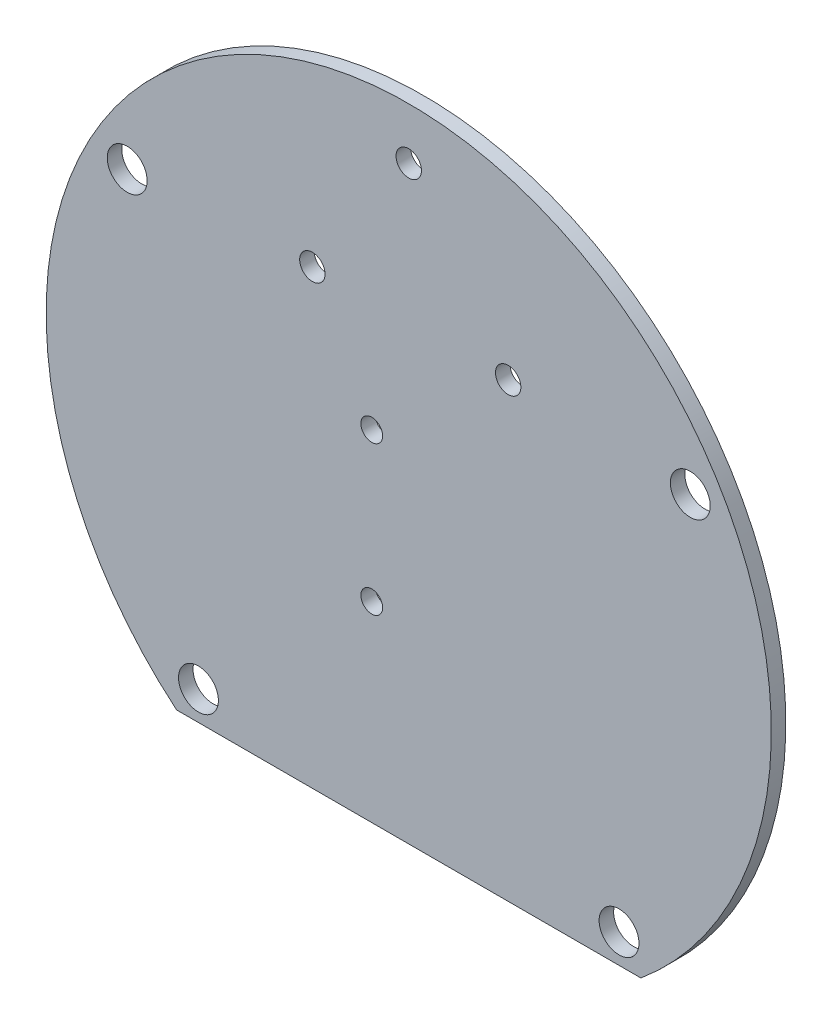
ISO-10303-21;
HEADER;
FILE_DESCRIPTION(('STEP AP214'),'2;1');
FILE_NAME('part.step','',(''),(''),'','','');
FILE_SCHEMA(('AUTOMOTIVE_DESIGN { 1 0 10303 214 1 1 1 1 }'));
ENDSEC;
DATA;
#1=APPLICATION_CONTEXT('core data for automotive mechanical design processes');
#2=APPLICATION_PROTOCOL_DEFINITION('international standard','automotive_design',2000,#1);
#3=PRODUCT_CONTEXT('',#1,'mechanical');
#4=PRODUCT('Part','Part','',(#3));
#5=PRODUCT_RELATED_PRODUCT_CATEGORY('part','',(#4));
#6=PRODUCT_DEFINITION_FORMATION('','',#4);
#7=PRODUCT_DEFINITION_CONTEXT('part definition',#1,'design');
#8=PRODUCT_DEFINITION('design','',#6,#7);
#9=PRODUCT_DEFINITION_SHAPE('','',#8);
#10=(LENGTH_UNIT() NAMED_UNIT(*) SI_UNIT(.MILLI.,.METRE.));
#11=(NAMED_UNIT(*) PLANE_ANGLE_UNIT() SI_UNIT($,.RADIAN.));
#12=(NAMED_UNIT(*) SI_UNIT($,.STERADIAN.) SOLID_ANGLE_UNIT());
#13=UNCERTAINTY_MEASURE_WITH_UNIT(LENGTH_MEASURE(1.E-05),#10,'distance_accuracy_value','');
#14=(GEOMETRIC_REPRESENTATION_CONTEXT(3) GLOBAL_UNCERTAINTY_ASSIGNED_CONTEXT((#13)) GLOBAL_UNIT_ASSIGNED_CONTEXT((#10,
#11,#12)) REPRESENTATION_CONTEXT('',''));
#15=CARTESIAN_POINT('',(0.,0.,0.));
#16=DIRECTION('',(0.,0.,1.));
#17=DIRECTION('',(1.,0.,0.));
#18=AXIS2_PLACEMENT_3D('',#15,#16,#17);
#19=CARTESIAN_POINT('',(0.,0.,2.));
#20=DIRECTION('',(0.,0.,-1.));
#21=DIRECTION('',(-1.,0.,0.));
#22=AXIS2_PLACEMENT_3D('',#19,#20,#21);
#23=CYLINDRICAL_SURFACE('',#22,50.);
#24=DIRECTION('',(0.,0.,-1.));
#25=VECTOR('',#24,1.);
#26=CARTESIAN_POINT('',(-32.0113353588168,-38.4093010681705,2.));
#27=LINE('',#26,#25);
#28=CARTESIAN_POINT('',(-32.0113353588168,-38.4093010681705,2.));
#29=VERTEX_POINT('',#28);
#30=CARTESIAN_POINT('',(-32.0113353588168,-38.4093010681705,0.));
#31=VERTEX_POINT('',#30);
#32=EDGE_CURVE('E49',#29,#31,#27,.T.);
#33=ORIENTED_EDGE('',*,*,#32,.F.);
#34=CARTESIAN_POINT('',(0.,0.,2.));
#35=DIRECTION('',(0.,0.,1.));
#36=DIRECTION('',(1.,0.,0.));
#37=AXIS2_PLACEMENT_3D('',#34,#35,#36);
#38=CIRCLE('',#37,50.);
#39=CARTESIAN_POINT('',(32.0113353588168,-38.4093010681705,2.));
#40=VERTEX_POINT('',#39);
#41=EDGE_CURVE('E43',#40,#29,#38,.T.);
#42=ORIENTED_EDGE('',*,*,#41,.F.);
#43=DIRECTION('',(0.,0.,-1.));
#44=VECTOR('',#43,1.);
#45=CARTESIAN_POINT('',(32.0113353588168,-38.4093010681705,2.));
#46=LINE('',#45,#44);
#47=CARTESIAN_POINT('',(32.0113353588168,-38.4093010681705,0.));
#48=VERTEX_POINT('',#47);
#49=EDGE_CURVE('E60',#48,#40,#46,.F.);
#50=ORIENTED_EDGE('',*,*,#49,.F.);
#51=CARTESIAN_POINT('',(0.,0.,0.));
#52=DIRECTION('',(0.,0.,1.));
#53=DIRECTION('',(1.,0.,0.));
#54=AXIS2_PLACEMENT_3D('',#51,#52,#53);
#55=CIRCLE('',#54,50.);
#56=EDGE_CURVE('E66',#48,#31,#55,.T.);
#57=ORIENTED_EDGE('',*,*,#56,.T.);
#58=EDGE_LOOP('',(#33,#42,#50,#57));
#59=FACE_BOUND('',#58,.T.);
#60=ADVANCED_FACE('F36',(#59),#23,.T.);
#61=CARTESIAN_POINT('',(0.,0.,2.));
#62=DIRECTION('',(0.,0.,1.));
#63=DIRECTION('',(1.,0.,0.));
#64=AXIS2_PLACEMENT_3D('',#61,#62,#63);
#65=PLANE('',#64);
#66=CARTESIAN_POINT('',(-5.09999999999999,-12.,2.));
#67=DIRECTION('',(0.,0.,1.));
#68=DIRECTION('',(1.,0.,0.));
#69=AXIS2_PLACEMENT_3D('',#66,#67,#68);
#70=CIRCLE('',#69,1.5);
#71=CARTESIAN_POINT('',(-3.59999999999999,-12.,2.));
#72=VERTEX_POINT('',#71);
#73=EDGE_CURVE('E68',#72,#72,#70,.T.);
#74=ORIENTED_EDGE('',*,*,#73,.F.);
#75=EDGE_LOOP('',(#74));
#76=FACE_BOUND('',#75,.T.);
#77=CARTESIAN_POINT('',(13.71,23.86,2.));
#78=DIRECTION('',(0.,0.,1.));
#79=DIRECTION('',(1.,0.,0.));
#80=AXIS2_PLACEMENT_3D('',#77,#78,#79);
#81=CIRCLE('',#80,1.75);
#82=CARTESIAN_POINT('',(15.46,23.86,2.));
#83=VERTEX_POINT('',#82);
#84=EDGE_CURVE('E101',#83,#83,#81,.T.);
#85=ORIENTED_EDGE('',*,*,#84,.F.);
#86=EDGE_LOOP('',(#85));
#87=FACE_BOUND('',#86,.T.);
#88=CARTESIAN_POINT('',(-13.29,23.86,2.));
#89=DIRECTION('',(0.,0.,1.));
#90=DIRECTION('',(1.,0.,0.));
#91=AXIS2_PLACEMENT_3D('',#88,#89,#90);
#92=CIRCLE('',#91,1.75);
#93=CARTESIAN_POINT('',(-11.54,23.86,2.));
#94=VERTEX_POINT('',#93);
#95=EDGE_CURVE('E104',#94,#94,#92,.T.);
#96=ORIENTED_EDGE('',*,*,#95,.F.);
#97=EDGE_LOOP('',(#96));
#98=FACE_BOUND('',#97,.T.);
#99=CARTESIAN_POINT('',(0.,42.87,2.));
#100=DIRECTION('',(0.,0.,1.));
#101=DIRECTION('',(1.,0.,0.));
#102=AXIS2_PLACEMENT_3D('',#99,#100,#101);
#103=CIRCLE('',#102,1.75);
#104=CARTESIAN_POINT('',(1.75,42.87,2.));
#105=VERTEX_POINT('',#104);
#106=EDGE_CURVE('E107',#105,#105,#103,.T.);
#107=ORIENTED_EDGE('',*,*,#106,.F.);
#108=EDGE_LOOP('',(#107));
#109=FACE_BOUND('',#108,.T.);
#110=CARTESIAN_POINT('',(-5.09999999999999,8.49999999999999,2.));
#111=DIRECTION('',(0.,0.,1.));
#112=DIRECTION('',(1.,0.,0.));
#113=AXIS2_PLACEMENT_3D('',#110,#111,#112);
#114=CIRCLE('',#113,1.5);
#115=CARTESIAN_POINT('',(-3.59999999999999,8.49999999999999,2.));
#116=VERTEX_POINT('',#115);
#117=EDGE_CURVE('E110',#116,#116,#114,.T.);
#118=ORIENTED_EDGE('',*,*,#117,.F.);
#119=EDGE_LOOP('',(#118));
#120=FACE_BOUND('',#119,.T.);
#121=CARTESIAN_POINT('',(38.8241975308642,22.7526193235952,2.));
#122=DIRECTION('',(0.,0.,1.));
#123=DIRECTION('',(1.,0.,0.));
#124=AXIS2_PLACEMENT_3D('',#121,#122,#123);
#125=CIRCLE('',#124,2.75);
#126=CARTESIAN_POINT('',(41.5741975308642,22.7526193235952,2.));
#127=VERTEX_POINT('',#126);
#128=EDGE_CURVE('E80',#127,#127,#125,.T.);
#129=ORIENTED_EDGE('',*,*,#128,.F.);
#130=EDGE_LOOP('',(#129));
#131=FACE_BOUND('',#130,.T.);
#132=CARTESIAN_POINT('',(-38.8241975308642,22.7526193235952,2.));
#133=DIRECTION('',(0.,0.,1.));
#134=DIRECTION('',(1.,0.,0.));
#135=AXIS2_PLACEMENT_3D('',#132,#133,#134);
#136=CIRCLE('',#135,2.75);
#137=CARTESIAN_POINT('',(-36.0741975308642,22.7526193235952,2.));
#138=VERTEX_POINT('',#137);
#139=EDGE_CURVE('E86',#138,#138,#136,.T.);
#140=ORIENTED_EDGE('',*,*,#139,.F.);
#141=EDGE_LOOP('',(#140));
#142=FACE_BOUND('',#141,.T.);
#143=CARTESIAN_POINT('',(29.,-34.4093010681705,2.));
#144=DIRECTION('',(0.,0.,1.));
#145=DIRECTION('',(1.,0.,0.));
#146=AXIS2_PLACEMENT_3D('',#143,#144,#145);
#147=CIRCLE('',#146,2.75);
#148=CARTESIAN_POINT('',(31.75,-34.4093010681705,2.));
#149=VERTEX_POINT('',#148);
#150=EDGE_CURVE('E92',#149,#149,#147,.T.);
#151=ORIENTED_EDGE('',*,*,#150,.F.);
#152=EDGE_LOOP('',(#151));
#153=FACE_BOUND('',#152,.T.);
#154=CARTESIAN_POINT('',(-29.,-34.4093010681705,2.));
#155=DIRECTION('',(0.,0.,1.));
#156=DIRECTION('',(1.,0.,0.));
#157=AXIS2_PLACEMENT_3D('',#154,#155,#156);
#158=CIRCLE('',#157,2.75);
#159=CARTESIAN_POINT('',(-26.25,-34.4093010681705,2.));
#160=VERTEX_POINT('',#159);
#161=EDGE_CURVE('E74',#160,#160,#158,.T.);
#162=ORIENTED_EDGE('',*,*,#161,.F.);
#163=EDGE_LOOP('',(#162));
#164=FACE_BOUND('',#163,.T.);
#165=ORIENTED_EDGE('',*,*,#41,.T.);
#166=DIRECTION('',(1.,0.,0.));
#167=VECTOR('',#166,1.);
#168=CARTESIAN_POINT('',(0.,-38.4093010681705,2.));
#169=LINE('',#168,#167);
#170=EDGE_CURVE('E54',#29,#40,#169,.T.);
#171=ORIENTED_EDGE('',*,*,#170,.T.);
#172=EDGE_LOOP('',(#165,#171));
#173=FACE_BOUND('',#172,.T.);
#174=ADVANCED_FACE('F134',(#76,#87,#98,#109,#120,#131,#142,#153,#164,#173),#65,.T.);
#175=CARTESIAN_POINT('',(0.,0.,0.));
#176=DIRECTION('',(0.,0.,1.));
#177=DIRECTION('',(1.,0.,0.));
#178=AXIS2_PLACEMENT_3D('',#175,#176,#177);
#179=PLANE('',#178);
#180=CARTESIAN_POINT('',(-5.09999999999999,-12.,0.));
#181=DIRECTION('',(0.,0.,-1.));
#182=DIRECTION('',(-1.,0.,0.));
#183=AXIS2_PLACEMENT_3D('',#180,#181,#182);
#184=CIRCLE('',#183,1.5);
#185=CARTESIAN_POINT('',(-6.59999999999999,-12.,0.));
#186=VERTEX_POINT('',#185);
#187=EDGE_CURVE('E116',#186,#186,#184,.T.);
#188=ORIENTED_EDGE('',*,*,#187,.F.);
#189=EDGE_LOOP('',(#188));
#190=FACE_BOUND('',#189,.T.);
#191=CARTESIAN_POINT('',(13.71,23.86,0.));
#192=DIRECTION('',(0.,0.,-1.));
#193=DIRECTION('',(-1.,0.,0.));
#194=AXIS2_PLACEMENT_3D('',#191,#192,#193);
#195=CIRCLE('',#194,1.75);
#196=CARTESIAN_POINT('',(11.96,23.86,0.));
#197=VERTEX_POINT('',#196);
#198=EDGE_CURVE('E117',#197,#197,#195,.T.);
#199=ORIENTED_EDGE('',*,*,#198,.F.);
#200=EDGE_LOOP('',(#199));
#201=FACE_BOUND('',#200,.T.);
#202=CARTESIAN_POINT('',(-13.29,23.86,0.));
#203=DIRECTION('',(0.,0.,-1.));
#204=DIRECTION('',(-1.,0.,0.));
#205=AXIS2_PLACEMENT_3D('',#202,#203,#204);
#206=CIRCLE('',#205,1.75);
#207=CARTESIAN_POINT('',(-15.04,23.86,0.));
#208=VERTEX_POINT('',#207);
#209=EDGE_CURVE('E120',#208,#208,#206,.T.);
#210=ORIENTED_EDGE('',*,*,#209,.F.);
#211=EDGE_LOOP('',(#210));
#212=FACE_BOUND('',#211,.T.);
#213=CARTESIAN_POINT('',(0.,42.87,0.));
#214=DIRECTION('',(0.,0.,-1.));
#215=DIRECTION('',(-1.,0.,0.));
#216=AXIS2_PLACEMENT_3D('',#213,#214,#215);
#217=CIRCLE('',#216,1.75);
#218=CARTESIAN_POINT('',(-1.75,42.87,0.));
#219=VERTEX_POINT('',#218);
#220=EDGE_CURVE('E123',#219,#219,#217,.T.);
#221=ORIENTED_EDGE('',*,*,#220,.F.);
#222=EDGE_LOOP('',(#221));
#223=FACE_BOUND('',#222,.T.);
#224=CARTESIAN_POINT('',(-5.09999999999999,8.49999999999999,0.));
#225=DIRECTION('',(0.,0.,-1.));
#226=DIRECTION('',(-1.,0.,0.));
#227=AXIS2_PLACEMENT_3D('',#224,#225,#226);
#228=CIRCLE('',#227,1.5);
#229=CARTESIAN_POINT('',(-6.59999999999999,8.49999999999999,0.));
#230=VERTEX_POINT('',#229);
#231=EDGE_CURVE('E113',#230,#230,#228,.T.);
#232=ORIENTED_EDGE('',*,*,#231,.F.);
#233=EDGE_LOOP('',(#232));
#234=FACE_BOUND('',#233,.T.);
#235=CARTESIAN_POINT('',(-29.,-34.4093010681705,0.));
#236=DIRECTION('',(0.,0.,1.));
#237=DIRECTION('',(1.,0.,0.));
#238=AXIS2_PLACEMENT_3D('',#235,#236,#237);
#239=CIRCLE('',#238,2.75);
#240=CARTESIAN_POINT('',(-26.25,-34.4093010681705,0.));
#241=VERTEX_POINT('',#240);
#242=EDGE_CURVE('E71',#241,#241,#239,.T.);
#243=ORIENTED_EDGE('',*,*,#242,.T.);
#244=EDGE_LOOP('',(#243));
#245=FACE_BOUND('',#244,.T.);
#246=CARTESIAN_POINT('',(29.,-34.4093010681705,0.));
#247=DIRECTION('',(0.,0.,1.));
#248=DIRECTION('',(1.,0.,0.));
#249=AXIS2_PLACEMENT_3D('',#246,#247,#248);
#250=CIRCLE('',#249,2.75);
#251=CARTESIAN_POINT('',(31.75,-34.4093010681705,0.));
#252=VERTEX_POINT('',#251);
#253=EDGE_CURVE('E78',#252,#252,#250,.T.);
#254=ORIENTED_EDGE('',*,*,#253,.T.);
#255=EDGE_LOOP('',(#254));
#256=FACE_BOUND('',#255,.T.);
#257=CARTESIAN_POINT('',(-38.8241975308642,22.7526193235952,0.));
#258=DIRECTION('',(0.,0.,1.));
#259=DIRECTION('',(1.,0.,0.));
#260=AXIS2_PLACEMENT_3D('',#257,#258,#259);
#261=CIRCLE('',#260,2.75);
#262=CARTESIAN_POINT('',(-36.0741975308642,22.7526193235952,0.));
#263=VERTEX_POINT('',#262);
#264=EDGE_CURVE('E89',#263,#263,#261,.T.);
#265=ORIENTED_EDGE('',*,*,#264,.T.);
#266=EDGE_LOOP('',(#265));
#267=FACE_BOUND('',#266,.T.);
#268=CARTESIAN_POINT('',(38.8241975308642,22.7526193235952,0.));
#269=DIRECTION('',(0.,0.,1.));
#270=DIRECTION('',(1.,0.,0.));
#271=AXIS2_PLACEMENT_3D('',#268,#269,#270);
#272=CIRCLE('',#271,2.75);
#273=CARTESIAN_POINT('',(41.5741975308642,22.7526193235952,0.));
#274=VERTEX_POINT('',#273);
#275=EDGE_CURVE('E83',#274,#274,#272,.T.);
#276=ORIENTED_EDGE('',*,*,#275,.T.);
#277=EDGE_LOOP('',(#276));
#278=FACE_BOUND('',#277,.T.);
#279=DIRECTION('',(1.,0.,0.));
#280=VECTOR('',#279,1.);
#281=CARTESIAN_POINT('',(0.,-38.4093010681705,0.));
#282=LINE('',#281,#280);
#283=EDGE_CURVE('E11',#31,#48,#282,.T.);
#284=ORIENTED_EDGE('',*,*,#283,.F.);
#285=ORIENTED_EDGE('',*,*,#56,.F.);
#286=EDGE_LOOP('',(#284,#285));
#287=FACE_BOUND('',#286,.T.);
#288=ADVANCED_FACE('F70',(#190,#201,#212,#223,#234,#245,#256,#267,#278,#287),#179,.F.);
#289=CARTESIAN_POINT('',(-29.,-34.4093010681705,0.));
#290=DIRECTION('',(0.,0.,1.));
#291=DIRECTION('',(1.,0.,0.));
#292=AXIS2_PLACEMENT_3D('',#289,#290,#291);
#293=CYLINDRICAL_SURFACE('',#292,2.75);
#294=ORIENTED_EDGE('',*,*,#242,.F.);
#295=EDGE_LOOP('',(#294));
#296=FACE_BOUND('',#295,.T.);
#297=ORIENTED_EDGE('',*,*,#161,.T.);
#298=EDGE_LOOP('',(#297));
#299=FACE_BOUND('',#298,.T.);
#300=ADVANCED_FACE('F133',(#296,#299),#293,.F.);
#301=CARTESIAN_POINT('',(29.,-34.4093010681705,0.));
#302=DIRECTION('',(0.,0.,1.));
#303=DIRECTION('',(1.,0.,0.));
#304=AXIS2_PLACEMENT_3D('',#301,#302,#303);
#305=CYLINDRICAL_SURFACE('',#304,2.75);
#306=ORIENTED_EDGE('',*,*,#253,.F.);
#307=EDGE_LOOP('',(#306));
#308=FACE_BOUND('',#307,.T.);
#309=ORIENTED_EDGE('',*,*,#150,.T.);
#310=EDGE_LOOP('',(#309));
#311=FACE_BOUND('',#310,.T.);
#312=ADVANCED_FACE('F167',(#308,#311),#305,.F.);
#313=CARTESIAN_POINT('',(-38.8241975308642,22.7526193235952,0.));
#314=DIRECTION('',(0.,0.,1.));
#315=DIRECTION('',(1.,0.,0.));
#316=AXIS2_PLACEMENT_3D('',#313,#314,#315);
#317=CYLINDRICAL_SURFACE('',#316,2.75);
#318=ORIENTED_EDGE('',*,*,#264,.F.);
#319=EDGE_LOOP('',(#318));
#320=FACE_BOUND('',#319,.T.);
#321=ORIENTED_EDGE('',*,*,#139,.T.);
#322=EDGE_LOOP('',(#321));
#323=FACE_BOUND('',#322,.T.);
#324=ADVANCED_FACE('F151',(#320,#323),#317,.F.);
#325=CARTESIAN_POINT('',(38.8241975308642,22.7526193235952,0.));
#326=DIRECTION('',(0.,0.,1.));
#327=DIRECTION('',(1.,0.,0.));
#328=AXIS2_PLACEMENT_3D('',#325,#326,#327);
#329=CYLINDRICAL_SURFACE('',#328,2.75);
#330=ORIENTED_EDGE('',*,*,#275,.F.);
#331=EDGE_LOOP('',(#330));
#332=FACE_BOUND('',#331,.T.);
#333=ORIENTED_EDGE('',*,*,#128,.T.);
#334=EDGE_LOOP('',(#333));
#335=FACE_BOUND('',#334,.T.);
#336=ADVANCED_FACE('F148',(#332,#335),#329,.F.);
#337=CARTESIAN_POINT('',(-40.7238599785686,-38.4093010681705,2.000012));
#338=DIRECTION('',(0.,-1.,0.));
#339=DIRECTION('',(0.,0.,-1.));
#340=AXIS2_PLACEMENT_3D('',#337,#338,#339);
#341=PLANE('',#340);
#342=ORIENTED_EDGE('',*,*,#32,.T.);
#343=ORIENTED_EDGE('',*,*,#283,.T.);
#344=ORIENTED_EDGE('',*,*,#49,.T.);
#345=ORIENTED_EDGE('',*,*,#170,.F.);
#346=EDGE_LOOP('',(#342,#343,#344,#345));
#347=FACE_BOUND('',#346,.T.);
#348=ADVANCED_FACE('F59',(#347),#341,.T.);
#349=CARTESIAN_POINT('',(-5.09999999999999,8.49999999999999,10.));
#350=DIRECTION('',(0.,0.,-1.));
#351=DIRECTION('',(-1.,0.,0.));
#352=AXIS2_PLACEMENT_3D('',#349,#350,#351);
#353=CYLINDRICAL_SURFACE('',#352,1.5);
#354=ORIENTED_EDGE('',*,*,#117,.T.);
#355=EDGE_LOOP('',(#354));
#356=FACE_BOUND('',#355,.T.);
#357=ORIENTED_EDGE('',*,*,#231,.T.);
#358=EDGE_LOOP('',(#357));
#359=FACE_BOUND('',#358,.T.);
#360=ADVANCED_FACE('F195',(#356,#359),#353,.F.);
#361=CARTESIAN_POINT('',(0.,42.87,10.));
#362=DIRECTION('',(0.,0.,-1.));
#363=DIRECTION('',(-1.,0.,0.));
#364=AXIS2_PLACEMENT_3D('',#361,#362,#363);
#365=CYLINDRICAL_SURFACE('',#364,1.75);
#366=ORIENTED_EDGE('',*,*,#106,.T.);
#367=EDGE_LOOP('',(#366));
#368=FACE_BOUND('',#367,.T.);
#369=ORIENTED_EDGE('',*,*,#220,.T.);
#370=EDGE_LOOP('',(#369));
#371=FACE_BOUND('',#370,.T.);
#372=ADVANCED_FACE('F206',(#368,#371),#365,.F.);
#373=CARTESIAN_POINT('',(-13.29,23.86,10.));
#374=DIRECTION('',(0.,0.,-1.));
#375=DIRECTION('',(-1.,0.,0.));
#376=AXIS2_PLACEMENT_3D('',#373,#374,#375);
#377=CYLINDRICAL_SURFACE('',#376,1.75);
#378=ORIENTED_EDGE('',*,*,#95,.T.);
#379=EDGE_LOOP('',(#378));
#380=FACE_BOUND('',#379,.T.);
#381=ORIENTED_EDGE('',*,*,#209,.T.);
#382=EDGE_LOOP('',(#381));
#383=FACE_BOUND('',#382,.T.);
#384=ADVANCED_FACE('F129',(#380,#383),#377,.F.);
#385=CARTESIAN_POINT('',(13.71,23.86,10.));
#386=DIRECTION('',(0.,0.,-1.));
#387=DIRECTION('',(-1.,0.,0.));
#388=AXIS2_PLACEMENT_3D('',#385,#386,#387);
#389=CYLINDRICAL_SURFACE('',#388,1.75);
#390=ORIENTED_EDGE('',*,*,#84,.T.);
#391=EDGE_LOOP('',(#390));
#392=FACE_BOUND('',#391,.T.);
#393=ORIENTED_EDGE('',*,*,#198,.T.);
#394=EDGE_LOOP('',(#393));
#395=FACE_BOUND('',#394,.T.);
#396=ADVANCED_FACE('F221',(#392,#395),#389,.F.);
#397=CARTESIAN_POINT('',(-5.09999999999999,-12.,10.));
#398=DIRECTION('',(0.,0.,-1.));
#399=DIRECTION('',(-1.,0.,0.));
#400=AXIS2_PLACEMENT_3D('',#397,#398,#399);
#401=CYLINDRICAL_SURFACE('',#400,1.5);
#402=ORIENTED_EDGE('',*,*,#73,.T.);
#403=EDGE_LOOP('',(#402));
#404=FACE_BOUND('',#403,.T.);
#405=ORIENTED_EDGE('',*,*,#187,.T.);
#406=EDGE_LOOP('',(#405));
#407=FACE_BOUND('',#406,.T.);
#408=ADVANCED_FACE('F229',(#404,#407),#401,.F.);
#409=CLOSED_SHELL('',(#60,#174,#288,#300,#312,#324,#336,#348,#360,#372,#384,#396,#408));
#410=MANIFOLD_SOLID_BREP('B2',#409);
#411=ADVANCED_BREP_SHAPE_REPRESENTATION('',(#18,#410),#14);
#412=SHAPE_DEFINITION_REPRESENTATION(#9,#411);
ENDSEC;
END-ISO-10303-21;
